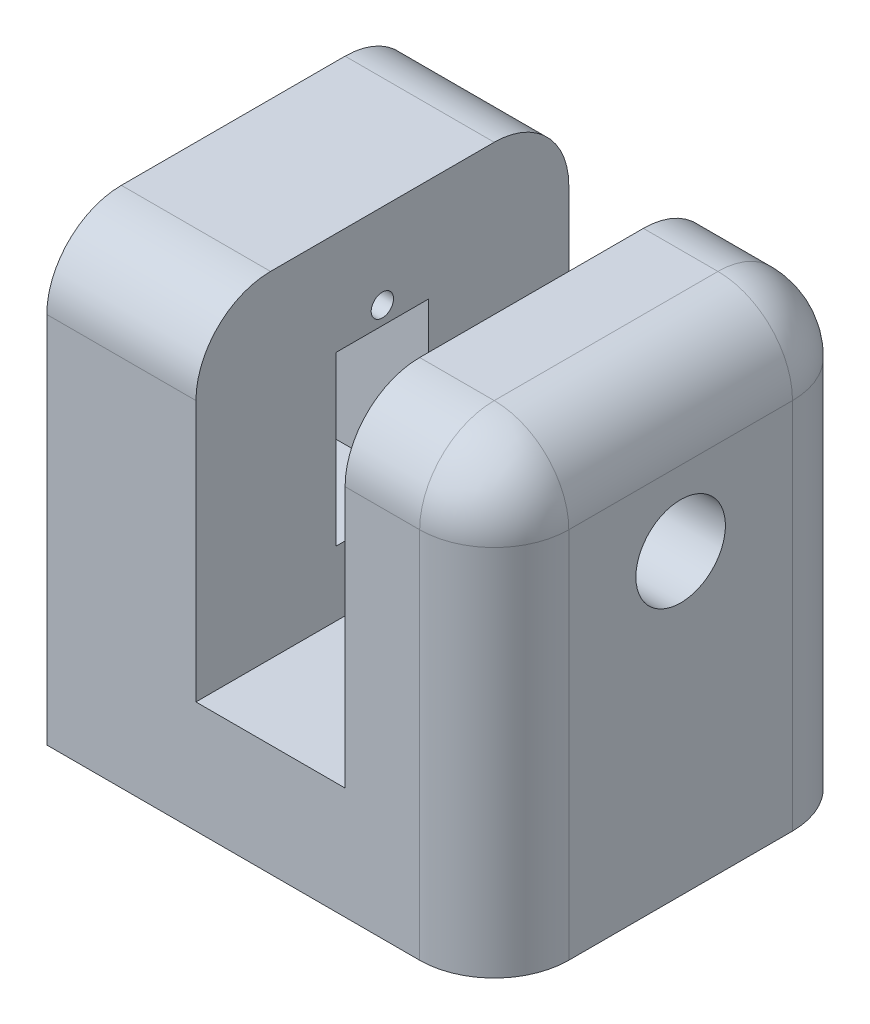
ISO-10303-21;
HEADER;
FILE_DESCRIPTION(('STEP AP214'),'2;1');
FILE_NAME('part.step','',(''),(''),'','','');
FILE_SCHEMA(('AUTOMOTIVE_DESIGN { 1 0 10303 214 1 1 1 1 }'));
ENDSEC;
DATA;
#1=APPLICATION_CONTEXT('core data for automotive mechanical design processes');
#2=APPLICATION_PROTOCOL_DEFINITION('international standard','automotive_design',2000,#1);
#3=PRODUCT_CONTEXT('',#1,'mechanical');
#4=PRODUCT('Part','Part','',(#3));
#5=PRODUCT_RELATED_PRODUCT_CATEGORY('part','',(#4));
#6=PRODUCT_DEFINITION_FORMATION('','',#4);
#7=PRODUCT_DEFINITION_CONTEXT('part definition',#1,'design');
#8=PRODUCT_DEFINITION('design','',#6,#7);
#9=PRODUCT_DEFINITION_SHAPE('','',#8);
#10=(LENGTH_UNIT() NAMED_UNIT(*) SI_UNIT(.MILLI.,.METRE.));
#11=(NAMED_UNIT(*) PLANE_ANGLE_UNIT() SI_UNIT($,.RADIAN.));
#12=(NAMED_UNIT(*) SI_UNIT($,.STERADIAN.) SOLID_ANGLE_UNIT());
#13=UNCERTAINTY_MEASURE_WITH_UNIT(LENGTH_MEASURE(1.E-05),#10,'distance_accuracy_value','');
#14=(GEOMETRIC_REPRESENTATION_CONTEXT(3) GLOBAL_UNCERTAINTY_ASSIGNED_CONTEXT((#13)) GLOBAL_UNIT_ASSIGNED_CONTEXT((#10,
#11,#12)) REPRESENTATION_CONTEXT('',''));
#15=CARTESIAN_POINT('',(0.,0.,0.));
#16=DIRECTION('',(0.,0.,1.));
#17=DIRECTION('',(1.,0.,0.));
#18=AXIS2_PLACEMENT_3D('',#15,#16,#17);
#19=CARTESIAN_POINT('',(0.,15.,0.));
#20=DIRECTION('',(0.,1.,0.));
#21=DIRECTION('',(0.,0.,1.));
#22=AXIS2_PLACEMENT_3D('',#19,#20,#21);
#23=PLANE('',#22);
#24=CARTESIAN_POINT('',(30.,15.,25.));
#25=DIRECTION('',(0.,1.,0.));
#26=DIRECTION('',(0.,0.,1.));
#27=AXIS2_PLACEMENT_3D('',#24,#25,#26);
#28=CIRCLE('',#27,2.5);
#29=CARTESIAN_POINT('',(30.,15.,27.5));
#30=VERTEX_POINT('',#29);
#31=EDGE_CURVE('E198',#30,#30,#28,.T.);
#32=ORIENTED_EDGE('',*,*,#31,.F.);
#33=EDGE_LOOP('',(#32));
#34=FACE_BOUND('',#33,.T.);
#35=DIRECTION('',(1.,0.,0.));
#36=VECTOR('',#35,1.);
#37=CARTESIAN_POINT('',(0.,15.,50.));
#38=LINE('',#37,#36);
#39=CARTESIAN_POINT('',(20.,15.,50.));
#40=VERTEX_POINT('',#39);
#41=CARTESIAN_POINT('',(40.,15.,50.));
#42=VERTEX_POINT('',#41);
#43=EDGE_CURVE('E230',#40,#42,#38,.T.);
#44=ORIENTED_EDGE('',*,*,#43,.T.);
#45=DIRECTION('',(0.,0.,1.));
#46=VECTOR('',#45,1.);
#47=CARTESIAN_POINT('',(40.,15.,0.));
#48=LINE('',#47,#46);
#49=CARTESIAN_POINT('',(40.,15.,0.));
#50=VERTEX_POINT('',#49);
#51=EDGE_CURVE('E211',#50,#42,#48,.T.);
#52=ORIENTED_EDGE('',*,*,#51,.F.);
#53=DIRECTION('',(-1.,0.,0.));
#54=VECTOR('',#53,1.);
#55=CARTESIAN_POINT('',(0.,15.,0.));
#56=LINE('',#55,#54);
#57=CARTESIAN_POINT('',(20.,15.,0.));
#58=VERTEX_POINT('',#57);
#59=EDGE_CURVE('E233',#50,#58,#56,.T.);
#60=ORIENTED_EDGE('',*,*,#59,.T.);
#61=DIRECTION('',(0.,0.,-1.));
#62=VECTOR('',#61,1.);
#63=CARTESIAN_POINT('',(20.,15.,0.));
#64=LINE('',#63,#62);
#65=EDGE_CURVE('E214',#40,#58,#64,.T.);
#66=ORIENTED_EDGE('',*,*,#65,.F.);
#67=EDGE_LOOP('',(#44,#52,#60,#66));
#68=FACE_BOUND('',#67,.T.);
#69=ADVANCED_FACE('F39',(#34,#68),#23,.T.);
#70=CARTESIAN_POINT('',(0.,15.,0.));
#71=DIRECTION('',(1.,0.,0.));
#72=DIRECTION('',(0.,0.,-1.));
#73=AXIS2_PLACEMENT_3D('',#70,#71,#72);
#74=PLANE('',#73);
#75=CARTESIAN_POINT('',(0.,21.3,25.));
#76=DIRECTION('',(-1.,0.,0.));
#77=DIRECTION('',(0.,0.,1.));
#78=AXIS2_PLACEMENT_3D('',#75,#76,#77);
#79=CIRCLE('',#78,1.5);
#80=CARTESIAN_POINT('',(0.,21.3,26.5));
#81=VERTEX_POINT('',#80);
#82=EDGE_CURVE('E490',#81,#81,#79,.T.);
#83=ORIENTED_EDGE('',*,*,#82,.F.);
#84=EDGE_LOOP('',(#83));
#85=FACE_BOUND('',#84,.T.);
#86=CARTESIAN_POINT('',(0.,48.6,25.));
#87=DIRECTION('',(-1.,0.,0.));
#88=DIRECTION('',(0.,0.,1.));
#89=AXIS2_PLACEMENT_3D('',#86,#87,#88);
#90=CIRCLE('',#89,1.5);
#91=CARTESIAN_POINT('',(0.,48.6,26.5));
#92=VERTEX_POINT('',#91);
#93=EDGE_CURVE('E488',#92,#92,#90,.T.);
#94=ORIENTED_EDGE('',*,*,#93,.F.);
#95=EDGE_LOOP('',(#94));
#96=FACE_BOUND('',#95,.T.);
#97=DIRECTION('',(0.,-1.,0.));
#98=VECTOR('',#97,1.);
#99=CARTESIAN_POINT('',(0.,0.,18.8));
#100=LINE('',#99,#98);
#101=CARTESIAN_POINT('',(0.,46.2,18.8));
#102=VERTEX_POINT('',#101);
#103=CARTESIAN_POINT('',(0.,23.7,18.8));
#104=VERTEX_POINT('',#103);
#105=EDGE_CURVE('E178',#102,#104,#100,.T.);
#106=ORIENTED_EDGE('',*,*,#105,.F.);
#107=DIRECTION('',(0.,0.,-1.));
#108=VECTOR('',#107,1.);
#109=CARTESIAN_POINT('',(0.,46.2,0.));
#110=LINE('',#109,#108);
#111=CARTESIAN_POINT('',(0.,46.2,31.2));
#112=VERTEX_POINT('',#111);
#113=EDGE_CURVE('E56',#112,#102,#110,.T.);
#114=ORIENTED_EDGE('',*,*,#113,.F.);
#115=DIRECTION('',(0.,-1.,0.));
#116=VECTOR('',#115,1.);
#117=CARTESIAN_POINT('',(0.,0.,31.2));
#118=LINE('',#117,#116);
#119=CARTESIAN_POINT('',(0.,23.7,31.2));
#120=VERTEX_POINT('',#119);
#121=EDGE_CURVE('E185',#112,#120,#118,.T.);
#122=ORIENTED_EDGE('',*,*,#121,.T.);
#123=DIRECTION('',(0.,0.,-1.));
#124=VECTOR('',#123,1.);
#125=CARTESIAN_POINT('',(0.,23.7,0.));
#126=LINE('',#125,#124);
#127=EDGE_CURVE('E169',#120,#104,#126,.T.);
#128=ORIENTED_EDGE('',*,*,#127,.T.);
#129=EDGE_LOOP('',(#106,#114,#122,#128));
#130=FACE_BOUND('',#129,.T.);
#131=DIRECTION('',(0.,-1.,0.));
#132=VECTOR('',#131,1.);
#133=CARTESIAN_POINT('',(0.,15.,50.));
#134=LINE('',#133,#132);
#135=CARTESIAN_POINT('',(0.,50.,50.));
#136=VERTEX_POINT('',#135);
#137=CARTESIAN_POINT('',(0.,0.,50.));
#138=VERTEX_POINT('',#137);
#139=EDGE_CURVE('E249',#136,#138,#134,.T.);
#140=ORIENTED_EDGE('',*,*,#139,.F.);
#141=CARTESIAN_POINT('',(0.,50.,40.));
#142=DIRECTION('',(1.,0.,0.));
#143=DIRECTION('',(0.,0.,-1.));
#144=AXIS2_PLACEMENT_3D('',#141,#142,#143);
#145=CIRCLE('',#144,10.);
#146=CARTESIAN_POINT('',(0.,60.,40.));
#147=VERTEX_POINT('',#146);
#148=EDGE_CURVE('E269',#136,#147,#145,.F.);
#149=ORIENTED_EDGE('',*,*,#148,.T.);
#150=DIRECTION('',(0.,0.,1.));
#151=VECTOR('',#150,1.);
#152=CARTESIAN_POINT('',(0.,60.,0.));
#153=LINE('',#152,#151);
#154=CARTESIAN_POINT('',(0.,60.,10.));
#155=VERTEX_POINT('',#154);
#156=EDGE_CURVE('E217',#155,#147,#153,.T.);
#157=ORIENTED_EDGE('',*,*,#156,.F.);
#158=CARTESIAN_POINT('',(0.,50.,10.));
#159=DIRECTION('',(1.,0.,0.));
#160=DIRECTION('',(0.,0.,-1.));
#161=AXIS2_PLACEMENT_3D('',#158,#159,#160);
#162=CIRCLE('',#161,10.);
#163=CARTESIAN_POINT('',(0.,50.,0.));
#164=VERTEX_POINT('',#163);
#165=EDGE_CURVE('E267',#155,#164,#162,.F.);
#166=ORIENTED_EDGE('',*,*,#165,.T.);
#167=DIRECTION('',(0.,-1.,0.));
#168=VECTOR('',#167,1.);
#169=CARTESIAN_POINT('',(0.,15.,0.));
#170=LINE('',#169,#168);
#171=CARTESIAN_POINT('',(0.,0.,0.));
#172=VERTEX_POINT('',#171);
#173=EDGE_CURVE('E237',#164,#172,#170,.T.);
#174=ORIENTED_EDGE('',*,*,#173,.T.);
#175=DIRECTION('',(0.,0.,1.));
#176=VECTOR('',#175,1.);
#177=CARTESIAN_POINT('',(0.,0.,0.));
#178=LINE('',#177,#176);
#179=EDGE_CURVE('E229',#172,#138,#178,.T.);
#180=ORIENTED_EDGE('',*,*,#179,.T.);
#181=EDGE_LOOP('',(#140,#149,#157,#166,#174,#180));
#182=FACE_BOUND('',#181,.T.);
#183=ADVANCED_FACE('F182',(#85,#96,#130,#182),#74,.F.);
#184=CARTESIAN_POINT('',(0.,15.,50.));
#185=DIRECTION('',(0.,0.,-1.));
#186=DIRECTION('',(-1.,0.,0.));
#187=AXIS2_PLACEMENT_3D('',#184,#185,#186);
#188=PLANE('',#187);
#189=DIRECTION('',(1.,0.,0.));
#190=VECTOR('',#189,1.);
#191=CARTESIAN_POINT('',(0.,0.,50.));
#192=LINE('',#191,#190);
#193=CARTESIAN_POINT('',(50.,0.,50.));
#194=VERTEX_POINT('',#193);
#195=EDGE_CURVE('E240',#138,#194,#192,.T.);
#196=ORIENTED_EDGE('',*,*,#195,.T.);
#197=DIRECTION('',(0.,-1.,0.));
#198=VECTOR('',#197,1.);
#199=CARTESIAN_POINT('',(50.,15.,50.));
#200=LINE('',#199,#198);
#201=CARTESIAN_POINT('',(50.,50.,50.));
#202=VERTEX_POINT('',#201);
#203=EDGE_CURVE('E304',#194,#202,#200,.F.);
#204=ORIENTED_EDGE('',*,*,#203,.T.);
#205=DIRECTION('',(1.,0.,0.));
#206=VECTOR('',#205,1.);
#207=CARTESIAN_POINT('',(0.,50.,50.));
#208=LINE('',#207,#206);
#209=CARTESIAN_POINT('',(40.,50.,50.));
#210=VERTEX_POINT('',#209);
#211=EDGE_CURVE('E263',#202,#210,#208,.F.);
#212=ORIENTED_EDGE('',*,*,#211,.T.);
#213=DIRECTION('',(0.,-1.,0.));
#214=VECTOR('',#213,1.);
#215=CARTESIAN_POINT('',(40.,60.,50.));
#216=LINE('',#215,#214);
#217=EDGE_CURVE('E208',#210,#42,#216,.T.);
#218=ORIENTED_EDGE('',*,*,#217,.T.);
#219=ORIENTED_EDGE('',*,*,#43,.F.);
#220=DIRECTION('',(0.,-1.,0.));
#221=VECTOR('',#220,1.);
#222=CARTESIAN_POINT('',(20.,60.,50.));
#223=LINE('',#222,#221);
#224=CARTESIAN_POINT('',(20.,50.,50.));
#225=VERTEX_POINT('',#224);
#226=EDGE_CURVE('E227',#225,#40,#223,.T.);
#227=ORIENTED_EDGE('',*,*,#226,.F.);
#228=DIRECTION('',(1.,0.,0.));
#229=VECTOR('',#228,1.);
#230=CARTESIAN_POINT('',(0.,50.,50.));
#231=LINE('',#230,#229);
#232=EDGE_CURVE('E265',#225,#136,#231,.F.);
#233=ORIENTED_EDGE('',*,*,#232,.T.);
#234=ORIENTED_EDGE('',*,*,#139,.T.);
#235=EDGE_LOOP('',(#196,#204,#212,#218,#219,#227,#233,#234));
#236=FACE_BOUND('',#235,.T.);
#237=ADVANCED_FACE('F348',(#236),#188,.F.);
#238=CARTESIAN_POINT('',(60.,15.,0.));
#239=DIRECTION('',(-1.,0.,0.));
#240=DIRECTION('',(0.,0.,1.));
#241=AXIS2_PLACEMENT_3D('',#238,#239,#240);
#242=PLANE('',#241);
#243=CARTESIAN_POINT('',(60.,40.,25.));
#244=DIRECTION('',(-1.,0.,0.));
#245=DIRECTION('',(0.,0.,1.));
#246=AXIS2_PLACEMENT_3D('',#243,#244,#245);
#247=CIRCLE('',#246,6.);
#248=CARTESIAN_POINT('',(60.,40.,31.));
#249=VERTEX_POINT('',#248);
#250=EDGE_CURVE('E203',#249,#249,#247,.T.);
#251=ORIENTED_EDGE('',*,*,#250,.T.);
#252=EDGE_LOOP('',(#251));
#253=FACE_BOUND('',#252,.T.);
#254=DIRECTION('',(0.,0.,-1.));
#255=VECTOR('',#254,1.);
#256=CARTESIAN_POINT('',(60.,0.,0.));
#257=LINE('',#256,#255);
#258=CARTESIAN_POINT('',(60.,0.,40.));
#259=VERTEX_POINT('',#258);
#260=CARTESIAN_POINT('',(60.,0.,10.));
#261=VERTEX_POINT('',#260);
#262=EDGE_CURVE('E243',#259,#261,#257,.T.);
#263=ORIENTED_EDGE('',*,*,#262,.T.);
#264=DIRECTION('',(0.,-1.,0.));
#265=VECTOR('',#264,1.);
#266=CARTESIAN_POINT('',(60.,15.,10.));
#267=LINE('',#266,#265);
#268=CARTESIAN_POINT('',(60.,50.,10.));
#269=VERTEX_POINT('',#268);
#270=EDGE_CURVE('E296',#261,#269,#267,.F.);
#271=ORIENTED_EDGE('',*,*,#270,.T.);
#272=DIRECTION('',(0.,0.,-1.));
#273=VECTOR('',#272,1.);
#274=CARTESIAN_POINT('',(60.,50.,0.));
#275=LINE('',#274,#273);
#276=CARTESIAN_POINT('',(60.,50.,40.));
#277=VERTEX_POINT('',#276);
#278=EDGE_CURVE('E294',#269,#277,#275,.F.);
#279=ORIENTED_EDGE('',*,*,#278,.T.);
#280=DIRECTION('',(0.,-1.,0.));
#281=VECTOR('',#280,1.);
#282=CARTESIAN_POINT('',(60.,15.,40.));
#283=LINE('',#282,#281);
#284=EDGE_CURVE('E292',#277,#259,#283,.T.);
#285=ORIENTED_EDGE('',*,*,#284,.T.);
#286=EDGE_LOOP('',(#263,#271,#279,#285));
#287=FACE_BOUND('',#286,.T.);
#288=ADVANCED_FACE('F363',(#253,#287),#242,.F.);
#289=CARTESIAN_POINT('',(0.,15.,0.));
#290=DIRECTION('',(0.,0.,1.));
#291=DIRECTION('',(1.,0.,0.));
#292=AXIS2_PLACEMENT_3D('',#289,#290,#291);
#293=PLANE('',#292);
#294=DIRECTION('',(-1.,0.,0.));
#295=VECTOR('',#294,1.);
#296=CARTESIAN_POINT('',(0.,50.,0.));
#297=LINE('',#296,#295);
#298=CARTESIAN_POINT('',(40.,50.,0.));
#299=VERTEX_POINT('',#298);
#300=CARTESIAN_POINT('',(50.,50.,0.));
#301=VERTEX_POINT('',#300);
#302=EDGE_CURVE('E282',#299,#301,#297,.F.);
#303=ORIENTED_EDGE('',*,*,#302,.T.);
#304=DIRECTION('',(0.,-1.,0.));
#305=VECTOR('',#304,1.);
#306=CARTESIAN_POINT('',(50.,15.,0.));
#307=LINE('',#306,#305);
#308=CARTESIAN_POINT('',(50.,0.,0.));
#309=VERTEX_POINT('',#308);
#310=EDGE_CURVE('E285',#301,#309,#307,.T.);
#311=ORIENTED_EDGE('',*,*,#310,.T.);
#312=DIRECTION('',(-1.,0.,0.));
#313=VECTOR('',#312,1.);
#314=CARTESIAN_POINT('',(0.,0.,0.));
#315=LINE('',#314,#313);
#316=EDGE_CURVE('E234',#309,#172,#315,.T.);
#317=ORIENTED_EDGE('',*,*,#316,.T.);
#318=ORIENTED_EDGE('',*,*,#173,.F.);
#319=DIRECTION('',(-1.,0.,0.));
#320=VECTOR('',#319,1.);
#321=CARTESIAN_POINT('',(20.,50.,0.));
#322=LINE('',#321,#320);
#323=CARTESIAN_POINT('',(20.,50.,0.));
#324=VERTEX_POINT('',#323);
#325=EDGE_CURVE('E280',#164,#324,#322,.F.);
#326=ORIENTED_EDGE('',*,*,#325,.T.);
#327=DIRECTION('',(0.,-1.,0.));
#328=VECTOR('',#327,1.);
#329=CARTESIAN_POINT('',(20.,60.,0.));
#330=LINE('',#329,#328);
#331=EDGE_CURVE('E223',#324,#58,#330,.T.);
#332=ORIENTED_EDGE('',*,*,#331,.T.);
#333=ORIENTED_EDGE('',*,*,#59,.F.);
#334=DIRECTION('',(0.,-1.,0.));
#335=VECTOR('',#334,1.);
#336=CARTESIAN_POINT('',(40.,60.,0.));
#337=LINE('',#336,#335);
#338=EDGE_CURVE('E206',#299,#50,#337,.T.);
#339=ORIENTED_EDGE('',*,*,#338,.F.);
#340=EDGE_LOOP('',(#303,#311,#317,#318,#326,#332,#333,#339));
#341=FACE_BOUND('',#340,.T.);
#342=ADVANCED_FACE('F359',(#341),#293,.F.);
#343=CARTESIAN_POINT('',(0.,0.,0.));
#344=DIRECTION('',(0.,1.,0.));
#345=DIRECTION('',(0.,0.,1.));
#346=AXIS2_PLACEMENT_3D('',#343,#344,#345);
#347=PLANE('',#346);
#348=CARTESIAN_POINT('',(30.,0.,25.));
#349=DIRECTION('',(0.,-1.,0.));
#350=DIRECTION('',(0.,0.,-1.));
#351=AXIS2_PLACEMENT_3D('',#348,#349,#350);
#352=CIRCLE('',#351,2.5);
#353=CARTESIAN_POINT('',(30.,0.,22.5));
#354=VERTEX_POINT('',#353);
#355=EDGE_CURVE('E195',#354,#354,#352,.T.);
#356=ORIENTED_EDGE('',*,*,#355,.F.);
#357=EDGE_LOOP('',(#356));
#358=FACE_BOUND('',#357,.T.);
#359=ORIENTED_EDGE('',*,*,#316,.F.);
#360=CARTESIAN_POINT('',(50.,0.,10.));
#361=DIRECTION('',(0.,1.,0.));
#362=DIRECTION('',(0.,0.,1.));
#363=AXIS2_PLACEMENT_3D('',#360,#361,#362);
#364=CIRCLE('',#363,10.);
#365=EDGE_CURVE('E290',#309,#261,#364,.F.);
#366=ORIENTED_EDGE('',*,*,#365,.T.);
#367=ORIENTED_EDGE('',*,*,#262,.F.);
#368=CARTESIAN_POINT('',(50.,0.,40.));
#369=DIRECTION('',(0.,1.,0.));
#370=DIRECTION('',(0.,0.,1.));
#371=AXIS2_PLACEMENT_3D('',#368,#369,#370);
#372=CIRCLE('',#371,10.);
#373=EDGE_CURVE('E288',#259,#194,#372,.F.);
#374=ORIENTED_EDGE('',*,*,#373,.T.);
#375=ORIENTED_EDGE('',*,*,#195,.F.);
#376=ORIENTED_EDGE('',*,*,#179,.F.);
#377=EDGE_LOOP('',(#359,#366,#367,#374,#375,#376));
#378=FACE_BOUND('',#377,.T.);
#379=ADVANCED_FACE('F356',(#358,#378),#347,.F.);
#380=CARTESIAN_POINT('',(20.,60.,0.));
#381=DIRECTION('',(-1.,0.,0.));
#382=DIRECTION('',(0.,0.,1.));
#383=AXIS2_PLACEMENT_3D('',#380,#381,#382);
#384=PLANE('',#383);
#385=CARTESIAN_POINT('',(20.,21.3,25.));
#386=DIRECTION('',(-1.,0.,0.));
#387=DIRECTION('',(0.,0.,1.));
#388=AXIS2_PLACEMENT_3D('',#385,#386,#387);
#389=CIRCLE('',#388,1.5);
#390=CARTESIAN_POINT('',(20.,21.3,26.5));
#391=VERTEX_POINT('',#390);
#392=EDGE_CURVE('E43',#391,#391,#389,.T.);
#393=ORIENTED_EDGE('',*,*,#392,.T.);
#394=EDGE_LOOP('',(#393));
#395=FACE_BOUND('',#394,.T.);
#396=CARTESIAN_POINT('',(20.,48.6,25.));
#397=DIRECTION('',(-1.,0.,0.));
#398=DIRECTION('',(0.,0.,1.));
#399=AXIS2_PLACEMENT_3D('',#396,#397,#398);
#400=CIRCLE('',#399,1.5);
#401=CARTESIAN_POINT('',(20.,48.6,26.5));
#402=VERTEX_POINT('',#401);
#403=EDGE_CURVE('E192',#402,#402,#400,.T.);
#404=ORIENTED_EDGE('',*,*,#403,.T.);
#405=EDGE_LOOP('',(#404));
#406=FACE_BOUND('',#405,.T.);
#407=DIRECTION('',(0.,-1.,0.));
#408=VECTOR('',#407,1.);
#409=CARTESIAN_POINT('',(20.,60.,31.2));
#410=LINE('',#409,#408);
#411=CARTESIAN_POINT('',(20.,46.2,31.2));
#412=VERTEX_POINT('',#411);
#413=CARTESIAN_POINT('',(20.,23.7,31.2));
#414=VERTEX_POINT('',#413);
#415=EDGE_CURVE('E48',#412,#414,#410,.T.);
#416=ORIENTED_EDGE('',*,*,#415,.F.);
#417=DIRECTION('',(0.,0.,-1.));
#418=VECTOR('',#417,1.);
#419=CARTESIAN_POINT('',(20.,46.2,0.));
#420=LINE('',#419,#418);
#421=CARTESIAN_POINT('',(20.,46.2,18.8));
#422=VERTEX_POINT('',#421);
#423=EDGE_CURVE('E11',#412,#422,#420,.T.);
#424=ORIENTED_EDGE('',*,*,#423,.T.);
#425=DIRECTION('',(0.,-1.,0.));
#426=VECTOR('',#425,1.);
#427=CARTESIAN_POINT('',(20.,60.,18.8));
#428=LINE('',#427,#426);
#429=CARTESIAN_POINT('',(20.,23.7,18.8));
#430=VERTEX_POINT('',#429);
#431=EDGE_CURVE('E306',#422,#430,#428,.T.);
#432=ORIENTED_EDGE('',*,*,#431,.T.);
#433=DIRECTION('',(0.,0.,-1.));
#434=VECTOR('',#433,1.);
#435=CARTESIAN_POINT('',(20.,23.7,0.));
#436=LINE('',#435,#434);
#437=EDGE_CURVE('E172',#414,#430,#436,.T.);
#438=ORIENTED_EDGE('',*,*,#437,.F.);
#439=EDGE_LOOP('',(#416,#424,#432,#438));
#440=FACE_BOUND('',#439,.T.);
#441=DIRECTION('',(0.,0.,-1.));
#442=VECTOR('',#441,1.);
#443=CARTESIAN_POINT('',(20.,60.,0.));
#444=LINE('',#443,#442);
#445=CARTESIAN_POINT('',(20.,60.,40.));
#446=VERTEX_POINT('',#445);
#447=CARTESIAN_POINT('',(20.,60.,10.));
#448=VERTEX_POINT('',#447);
#449=EDGE_CURVE('E220',#446,#448,#444,.T.);
#450=ORIENTED_EDGE('',*,*,#449,.F.);
#451=CARTESIAN_POINT('',(20.,50.,40.));
#452=DIRECTION('',(-1.,0.,0.));
#453=DIRECTION('',(0.,0.,1.));
#454=AXIS2_PLACEMENT_3D('',#451,#452,#453);
#455=CIRCLE('',#454,10.);
#456=EDGE_CURVE('E261',#446,#225,#455,.F.);
#457=ORIENTED_EDGE('',*,*,#456,.T.);
#458=ORIENTED_EDGE('',*,*,#226,.T.);
#459=ORIENTED_EDGE('',*,*,#65,.T.);
#460=ORIENTED_EDGE('',*,*,#331,.F.);
#461=CARTESIAN_POINT('',(20.,50.,10.));
#462=DIRECTION('',(-1.,0.,0.));
#463=DIRECTION('',(0.,0.,1.));
#464=AXIS2_PLACEMENT_3D('',#461,#462,#463);
#465=CIRCLE('',#464,10.);
#466=EDGE_CURVE('E259',#324,#448,#465,.F.);
#467=ORIENTED_EDGE('',*,*,#466,.T.);
#468=EDGE_LOOP('',(#450,#457,#458,#459,#460,#467));
#469=FACE_BOUND('',#468,.T.);
#470=ADVANCED_FACE('F326',(#395,#406,#440,#469),#384,.F.);
#471=CARTESIAN_POINT('',(0.,60.,0.));
#472=DIRECTION('',(0.,1.,0.));
#473=DIRECTION('',(0.,0.,1.));
#474=AXIS2_PLACEMENT_3D('',#471,#472,#473);
#475=PLANE('',#474);
#476=ORIENTED_EDGE('',*,*,#156,.T.);
#477=DIRECTION('',(1.,0.,0.));
#478=VECTOR('',#477,1.);
#479=CARTESIAN_POINT('',(20.,60.,40.));
#480=LINE('',#479,#478);
#481=EDGE_CURVE('E256',#147,#446,#480,.T.);
#482=ORIENTED_EDGE('',*,*,#481,.T.);
#483=ORIENTED_EDGE('',*,*,#449,.T.);
#484=DIRECTION('',(-1.,0.,0.));
#485=VECTOR('',#484,1.);
#486=CARTESIAN_POINT('',(0.,60.,10.));
#487=LINE('',#486,#485);
#488=EDGE_CURVE('E251',#448,#155,#487,.T.);
#489=ORIENTED_EDGE('',*,*,#488,.T.);
#490=EDGE_LOOP('',(#476,#482,#483,#489));
#491=FACE_BOUND('',#490,.T.);
#492=ADVANCED_FACE('F438',(#491),#475,.T.);
#493=CARTESIAN_POINT('',(40.,60.,0.));
#494=DIRECTION('',(1.,0.,0.));
#495=DIRECTION('',(0.,0.,-1.));
#496=AXIS2_PLACEMENT_3D('',#493,#494,#495);
#497=PLANE('',#496);
#498=CARTESIAN_POINT('',(40.,40.,25.));
#499=DIRECTION('',(1.,0.,0.));
#500=DIRECTION('',(0.,0.,-1.));
#501=AXIS2_PLACEMENT_3D('',#498,#499,#500);
#502=CIRCLE('',#501,6.);
#503=CARTESIAN_POINT('',(40.,40.,19.));
#504=VERTEX_POINT('',#503);
#505=EDGE_CURVE('E202',#504,#504,#502,.T.);
#506=ORIENTED_EDGE('',*,*,#505,.T.);
#507=EDGE_LOOP('',(#506));
#508=FACE_BOUND('',#507,.T.);
#509=ORIENTED_EDGE('',*,*,#217,.F.);
#510=CARTESIAN_POINT('',(40.,50.,40.));
#511=DIRECTION('',(1.,0.,0.));
#512=DIRECTION('',(0.,0.,-1.));
#513=AXIS2_PLACEMENT_3D('',#510,#511,#512);
#514=CIRCLE('',#513,10.);
#515=CARTESIAN_POINT('',(40.,60.,40.));
#516=VERTEX_POINT('',#515);
#517=EDGE_CURVE('E278',#210,#516,#514,.F.);
#518=ORIENTED_EDGE('',*,*,#517,.T.);
#519=DIRECTION('',(0.,0.,1.));
#520=VECTOR('',#519,1.);
#521=CARTESIAN_POINT('',(40.,60.,0.));
#522=LINE('',#521,#520);
#523=CARTESIAN_POINT('',(40.,60.,10.));
#524=VERTEX_POINT('',#523);
#525=EDGE_CURVE('E210',#524,#516,#522,.T.);
#526=ORIENTED_EDGE('',*,*,#525,.F.);
#527=CARTESIAN_POINT('',(40.,50.,10.));
#528=DIRECTION('',(1.,0.,0.));
#529=DIRECTION('',(0.,0.,-1.));
#530=AXIS2_PLACEMENT_3D('',#527,#528,#529);
#531=CIRCLE('',#530,10.);
#532=EDGE_CURVE('E276',#524,#299,#531,.F.);
#533=ORIENTED_EDGE('',*,*,#532,.T.);
#534=ORIENTED_EDGE('',*,*,#338,.T.);
#535=ORIENTED_EDGE('',*,*,#51,.T.);
#536=EDGE_LOOP('',(#509,#518,#526,#533,#534,#535));
#537=FACE_BOUND('',#536,.T.);
#538=ADVANCED_FACE('F421',(#508,#537),#497,.F.);
#539=CARTESIAN_POINT('',(0.,60.,0.));
#540=DIRECTION('',(0.,-1.,0.));
#541=DIRECTION('',(0.,0.,-1.));
#542=AXIS2_PLACEMENT_3D('',#539,#540,#541);
#543=PLANE('',#542);
#544=DIRECTION('',(1.,0.,0.));
#545=VECTOR('',#544,1.);
#546=CARTESIAN_POINT('',(0.,60.,40.));
#547=LINE('',#546,#545);
#548=CARTESIAN_POINT('',(50.,60.,40.));
#549=VERTEX_POINT('',#548);
#550=EDGE_CURVE('E273',#516,#549,#547,.T.);
#551=ORIENTED_EDGE('',*,*,#550,.T.);
#552=DIRECTION('',(0.,0.,-1.));
#553=VECTOR('',#552,1.);
#554=CARTESIAN_POINT('',(50.,60.,0.));
#555=LINE('',#554,#553);
#556=CARTESIAN_POINT('',(50.,60.,10.));
#557=VERTEX_POINT('',#556);
#558=EDGE_CURVE('E300',#549,#557,#555,.T.);
#559=ORIENTED_EDGE('',*,*,#558,.T.);
#560=DIRECTION('',(-1.,0.,0.));
#561=VECTOR('',#560,1.);
#562=CARTESIAN_POINT('',(0.,60.,10.));
#563=LINE('',#562,#561);
#564=EDGE_CURVE('E271',#557,#524,#563,.T.);
#565=ORIENTED_EDGE('',*,*,#564,.T.);
#566=ORIENTED_EDGE('',*,*,#525,.T.);
#567=EDGE_LOOP('',(#551,#559,#565,#566));
#568=FACE_BOUND('',#567,.T.);
#569=ADVANCED_FACE('F415',(#568),#543,.F.);
#570=CARTESIAN_POINT('',(84.,40.,25.));
#571=DIRECTION('',(-1.,0.,0.));
#572=DIRECTION('',(0.,0.,1.));
#573=AXIS2_PLACEMENT_3D('',#570,#571,#572);
#574=CYLINDRICAL_SURFACE('',#573,6.);
#575=ORIENTED_EDGE('',*,*,#505,.F.);
#576=EDGE_LOOP('',(#575));
#577=FACE_BOUND('',#576,.T.);
#578=ORIENTED_EDGE('',*,*,#250,.F.);
#579=EDGE_LOOP('',(#578));
#580=FACE_BOUND('',#579,.T.);
#581=ADVANCED_FACE('F467',(#577,#580),#574,.F.);
#582=CARTESIAN_POINT('',(30.,19.,25.));
#583=DIRECTION('',(0.,-1.,0.));
#584=DIRECTION('',(0.,0.,-1.));
#585=AXIS2_PLACEMENT_3D('',#582,#583,#584);
#586=CYLINDRICAL_SURFACE('',#585,2.5);
#587=ORIENTED_EDGE('',*,*,#31,.T.);
#588=EDGE_LOOP('',(#587));
#589=FACE_BOUND('',#588,.T.);
#590=ORIENTED_EDGE('',*,*,#355,.T.);
#591=EDGE_LOOP('',(#590));
#592=FACE_BOUND('',#591,.T.);
#593=ADVANCED_FACE('F375',(#589,#592),#586,.F.);
#594=CARTESIAN_POINT('',(0.,50.,40.));
#595=DIRECTION('',(-1.,0.,0.));
#596=DIRECTION('',(0.,0.,1.));
#597=AXIS2_PLACEMENT_3D('',#594,#595,#596);
#598=CYLINDRICAL_SURFACE('',#597,10.);
#599=ORIENTED_EDGE('',*,*,#148,.F.);
#600=ORIENTED_EDGE('',*,*,#232,.F.);
#601=ORIENTED_EDGE('',*,*,#456,.F.);
#602=ORIENTED_EDGE('',*,*,#481,.F.);
#603=EDGE_LOOP('',(#599,#600,#601,#602));
#604=FACE_BOUND('',#603,.T.);
#605=ADVANCED_FACE('F371',(#604),#598,.T.);
#606=CARTESIAN_POINT('',(0.,50.,40.));
#607=DIRECTION('',(1.,0.,0.));
#608=DIRECTION('',(0.,0.,-1.));
#609=AXIS2_PLACEMENT_3D('',#606,#607,#608);
#610=CYLINDRICAL_SURFACE('',#609,10.);
#611=ORIENTED_EDGE('',*,*,#211,.F.);
#612=CARTESIAN_POINT('',(50.,50.,40.));
#613=DIRECTION('',(1.,0.,0.));
#614=DIRECTION('',(0.,0.,-1.));
#615=AXIS2_PLACEMENT_3D('',#612,#613,#614);
#616=CIRCLE('',#615,10.);
#617=EDGE_CURVE('E302',#202,#549,#616,.F.);
#618=ORIENTED_EDGE('',*,*,#617,.T.);
#619=ORIENTED_EDGE('',*,*,#550,.F.);
#620=ORIENTED_EDGE('',*,*,#517,.F.);
#621=EDGE_LOOP('',(#611,#618,#619,#620));
#622=FACE_BOUND('',#621,.T.);
#623=ADVANCED_FACE('F374',(#622),#610,.T.);
#624=CARTESIAN_POINT('',(0.,50.,10.));
#625=DIRECTION('',(-1.,0.,0.));
#626=DIRECTION('',(0.,0.,1.));
#627=AXIS2_PLACEMENT_3D('',#624,#625,#626);
#628=CYLINDRICAL_SURFACE('',#627,10.);
#629=ORIENTED_EDGE('',*,*,#564,.F.);
#630=CARTESIAN_POINT('',(50.,50.,10.));
#631=DIRECTION('',(-1.,0.,0.));
#632=DIRECTION('',(0.,0.,1.));
#633=AXIS2_PLACEMENT_3D('',#630,#631,#632);
#634=CIRCLE('',#633,10.);
#635=EDGE_CURVE('E298',#557,#301,#634,.T.);
#636=ORIENTED_EDGE('',*,*,#635,.T.);
#637=ORIENTED_EDGE('',*,*,#302,.F.);
#638=ORIENTED_EDGE('',*,*,#532,.F.);
#639=EDGE_LOOP('',(#629,#636,#637,#638));
#640=FACE_BOUND('',#639,.T.);
#641=ADVANCED_FACE('F379',(#640),#628,.T.);
#642=CARTESIAN_POINT('',(0.,50.,10.));
#643=DIRECTION('',(1.,0.,0.));
#644=DIRECTION('',(0.,0.,-1.));
#645=AXIS2_PLACEMENT_3D('',#642,#643,#644);
#646=CYLINDRICAL_SURFACE('',#645,10.);
#647=ORIENTED_EDGE('',*,*,#466,.F.);
#648=ORIENTED_EDGE('',*,*,#325,.F.);
#649=ORIENTED_EDGE('',*,*,#165,.F.);
#650=ORIENTED_EDGE('',*,*,#488,.F.);
#651=EDGE_LOOP('',(#647,#648,#649,#650));
#652=FACE_BOUND('',#651,.T.);
#653=ADVANCED_FACE('F383',(#652),#646,.T.);
#654=CARTESIAN_POINT('',(50.,15.,40.));
#655=DIRECTION('',(0.,-1.,0.));
#656=DIRECTION('',(0.,0.,-1.));
#657=AXIS2_PLACEMENT_3D('',#654,#655,#656);
#658=CYLINDRICAL_SURFACE('',#657,10.);
#659=CARTESIAN_POINT('',(50.,50.,40.));
#660=DIRECTION('',(0.,1.,0.));
#661=DIRECTION('',(0.,0.,1.));
#662=AXIS2_PLACEMENT_3D('',#659,#660,#661);
#663=CIRCLE('',#662,10.);
#664=EDGE_CURVE('E199',#202,#277,#663,.T.);
#665=ORIENTED_EDGE('',*,*,#664,.F.);
#666=ORIENTED_EDGE('',*,*,#203,.F.);
#667=ORIENTED_EDGE('',*,*,#373,.F.);
#668=ORIENTED_EDGE('',*,*,#284,.F.);
#669=EDGE_LOOP('',(#665,#666,#667,#668));
#670=FACE_BOUND('',#669,.T.);
#671=ADVANCED_FACE('F41',(#670),#658,.T.);
#672=CARTESIAN_POINT('',(50.,50.,40.));
#673=DIRECTION('',(-1.,0.,0.));
#674=DIRECTION('',(0.,0.,1.));
#675=AXIS2_PLACEMENT_3D('',#672,#673,#674);
#676=SPHERICAL_SURFACE('',#675,10.);
#677=ORIENTED_EDGE('',*,*,#617,.F.);
#678=ORIENTED_EDGE('',*,*,#664,.T.);
#679=CARTESIAN_POINT('',(50.,50.,40.));
#680=DIRECTION('',(0.,0.,-1.));
#681=DIRECTION('',(-1.,0.,0.));
#682=AXIS2_PLACEMENT_3D('',#679,#680,#681);
#683=CIRCLE('',#682,10.);
#684=EDGE_CURVE('E313',#549,#277,#683,.T.);
#685=ORIENTED_EDGE('',*,*,#684,.F.);
#686=EDGE_LOOP('',(#677,#678,#685));
#687=FACE_BOUND('',#686,.T.);
#688=ADVANCED_FACE('F399',(#687),#676,.T.);
#689=CARTESIAN_POINT('',(50.,50.,0.));
#690=DIRECTION('',(0.,0.,-1.));
#691=DIRECTION('',(-1.,0.,0.));
#692=AXIS2_PLACEMENT_3D('',#689,#690,#691);
#693=CYLINDRICAL_SURFACE('',#692,10.);
#694=CARTESIAN_POINT('',(50.,50.,10.));
#695=DIRECTION('',(0.,0.,-1.));
#696=DIRECTION('',(-1.,0.,0.));
#697=AXIS2_PLACEMENT_3D('',#694,#695,#696);
#698=CIRCLE('',#697,10.);
#699=EDGE_CURVE('E310',#557,#269,#698,.T.);
#700=ORIENTED_EDGE('',*,*,#699,.F.);
#701=ORIENTED_EDGE('',*,*,#558,.F.);
#702=ORIENTED_EDGE('',*,*,#684,.T.);
#703=ORIENTED_EDGE('',*,*,#278,.F.);
#704=EDGE_LOOP('',(#700,#701,#702,#703));
#705=FACE_BOUND('',#704,.T.);
#706=ADVANCED_FACE('F396',(#705),#693,.T.);
#707=CARTESIAN_POINT('',(50.,50.,10.));
#708=DIRECTION('',(-1.,0.,0.));
#709=DIRECTION('',(0.,0.,1.));
#710=AXIS2_PLACEMENT_3D('',#707,#708,#709);
#711=SPHERICAL_SURFACE('',#710,10.);
#712=ORIENTED_EDGE('',*,*,#635,.F.);
#713=ORIENTED_EDGE('',*,*,#699,.T.);
#714=CARTESIAN_POINT('',(50.,50.,10.));
#715=DIRECTION('',(0.,-1.,0.));
#716=DIRECTION('',(0.,0.,-1.));
#717=AXIS2_PLACEMENT_3D('',#714,#715,#716);
#718=CIRCLE('',#717,10.);
#719=EDGE_CURVE('E307',#301,#269,#718,.T.);
#720=ORIENTED_EDGE('',*,*,#719,.F.);
#721=EDGE_LOOP('',(#712,#713,#720));
#722=FACE_BOUND('',#721,.T.);
#723=ADVANCED_FACE('F392',(#722),#711,.T.);
#724=CARTESIAN_POINT('',(50.,15.,10.));
#725=DIRECTION('',(0.,-1.,0.));
#726=DIRECTION('',(0.,0.,-1.));
#727=AXIS2_PLACEMENT_3D('',#724,#725,#726);
#728=CYLINDRICAL_SURFACE('',#727,10.);
#729=ORIENTED_EDGE('',*,*,#719,.T.);
#730=ORIENTED_EDGE('',*,*,#270,.F.);
#731=ORIENTED_EDGE('',*,*,#365,.F.);
#732=ORIENTED_EDGE('',*,*,#310,.F.);
#733=EDGE_LOOP('',(#729,#730,#731,#732));
#734=FACE_BOUND('',#733,.T.);
#735=ADVANCED_FACE('F388',(#734),#728,.T.);
#736=CARTESIAN_POINT('',(30.,46.2,0.));
#737=DIRECTION('',(0.,1.,0.));
#738=DIRECTION('',(0.,0.,1.));
#739=AXIS2_PLACEMENT_3D('',#736,#737,#738);
#740=PLANE('',#739);
#741=DIRECTION('',(-1.,0.,0.));
#742=VECTOR('',#741,1.);
#743=CARTESIAN_POINT('',(30.,46.2,31.2));
#744=LINE('',#743,#742);
#745=EDGE_CURVE('E190',#412,#112,#744,.T.);
#746=ORIENTED_EDGE('',*,*,#745,.T.);
#747=ORIENTED_EDGE('',*,*,#113,.T.);
#748=DIRECTION('',(-1.,0.,0.));
#749=VECTOR('',#748,1.);
#750=CARTESIAN_POINT('',(30.,46.2,18.8));
#751=LINE('',#750,#749);
#752=EDGE_CURVE('E175',#422,#102,#751,.T.);
#753=ORIENTED_EDGE('',*,*,#752,.F.);
#754=ORIENTED_EDGE('',*,*,#423,.F.);
#755=EDGE_LOOP('',(#746,#747,#753,#754));
#756=FACE_BOUND('',#755,.T.);
#757=ADVANCED_FACE('F391',(#756),#740,.F.);
#758=CARTESIAN_POINT('',(30.,0.,31.2));
#759=DIRECTION('',(0.,0.,-1.));
#760=DIRECTION('',(-1.,0.,0.));
#761=AXIS2_PLACEMENT_3D('',#758,#759,#760);
#762=PLANE('',#761);
#763=ORIENTED_EDGE('',*,*,#415,.T.);
#764=DIRECTION('',(-1.,0.,0.));
#765=VECTOR('',#764,1.);
#766=CARTESIAN_POINT('',(30.,23.7,31.2));
#767=LINE('',#766,#765);
#768=EDGE_CURVE('E174',#414,#120,#767,.T.);
#769=ORIENTED_EDGE('',*,*,#768,.T.);
#770=ORIENTED_EDGE('',*,*,#121,.F.);
#771=ORIENTED_EDGE('',*,*,#745,.F.);
#772=EDGE_LOOP('',(#763,#769,#770,#771));
#773=FACE_BOUND('',#772,.T.);
#774=ADVANCED_FACE('F477',(#773),#762,.T.);
#775=CARTESIAN_POINT('',(30.,23.7,0.));
#776=DIRECTION('',(0.,1.,0.));
#777=DIRECTION('',(0.,0.,1.));
#778=AXIS2_PLACEMENT_3D('',#775,#776,#777);
#779=PLANE('',#778);
#780=ORIENTED_EDGE('',*,*,#437,.T.);
#781=DIRECTION('',(-1.,0.,0.));
#782=VECTOR('',#781,1.);
#783=CARTESIAN_POINT('',(30.,23.7,18.8));
#784=LINE('',#783,#782);
#785=EDGE_CURVE('E64',#430,#104,#784,.T.);
#786=ORIENTED_EDGE('',*,*,#785,.T.);
#787=ORIENTED_EDGE('',*,*,#127,.F.);
#788=ORIENTED_EDGE('',*,*,#768,.F.);
#789=EDGE_LOOP('',(#780,#786,#787,#788));
#790=FACE_BOUND('',#789,.T.);
#791=ADVANCED_FACE('F166',(#790),#779,.T.);
#792=CARTESIAN_POINT('',(30.,0.,18.8));
#793=DIRECTION('',(0.,0.,-1.));
#794=DIRECTION('',(-1.,0.,0.));
#795=AXIS2_PLACEMENT_3D('',#792,#793,#794);
#796=PLANE('',#795);
#797=ORIENTED_EDGE('',*,*,#752,.T.);
#798=ORIENTED_EDGE('',*,*,#105,.T.);
#799=ORIENTED_EDGE('',*,*,#785,.F.);
#800=ORIENTED_EDGE('',*,*,#431,.F.);
#801=EDGE_LOOP('',(#797,#798,#799,#800));
#802=FACE_BOUND('',#801,.T.);
#803=ADVANCED_FACE('F179',(#802),#796,.F.);
#804=CARTESIAN_POINT('',(30.,48.6,25.));
#805=DIRECTION('',(-1.,0.,0.));
#806=DIRECTION('',(0.,0.,1.));
#807=AXIS2_PLACEMENT_3D('',#804,#805,#806);
#808=CYLINDRICAL_SURFACE('',#807,1.5);
#809=ORIENTED_EDGE('',*,*,#93,.T.);
#810=EDGE_LOOP('',(#809));
#811=FACE_BOUND('',#810,.T.);
#812=ORIENTED_EDGE('',*,*,#403,.F.);
#813=EDGE_LOOP('',(#812));
#814=FACE_BOUND('',#813,.T.);
#815=ADVANCED_FACE('F330',(#811,#814),#808,.F.);
#816=CARTESIAN_POINT('',(30.,21.3,25.));
#817=DIRECTION('',(-1.,0.,0.));
#818=DIRECTION('',(0.,0.,1.));
#819=AXIS2_PLACEMENT_3D('',#816,#817,#818);
#820=CYLINDRICAL_SURFACE('',#819,1.5);
#821=ORIENTED_EDGE('',*,*,#82,.T.);
#822=EDGE_LOOP('',(#821));
#823=FACE_BOUND('',#822,.T.);
#824=ORIENTED_EDGE('',*,*,#392,.F.);
#825=EDGE_LOOP('',(#824));
#826=FACE_BOUND('',#825,.T.);
#827=ADVANCED_FACE('F328',(#823,#826),#820,.F.);
#828=CLOSED_SHELL('',(#69,#183,#237,#288,#342,#379,#470,#492,#538,#569,#581,#593,#605,#623,#641,
#653,#671,#688,#706,#723,#735,#757,#774,#791,#803,#815,#827));
#829=MANIFOLD_SOLID_BREP('B2',#828);
#830=ADVANCED_BREP_SHAPE_REPRESENTATION('',(#18,#829),#14);
#831=SHAPE_DEFINITION_REPRESENTATION(#9,#830);
ENDSEC;
END-ISO-10303-21;
